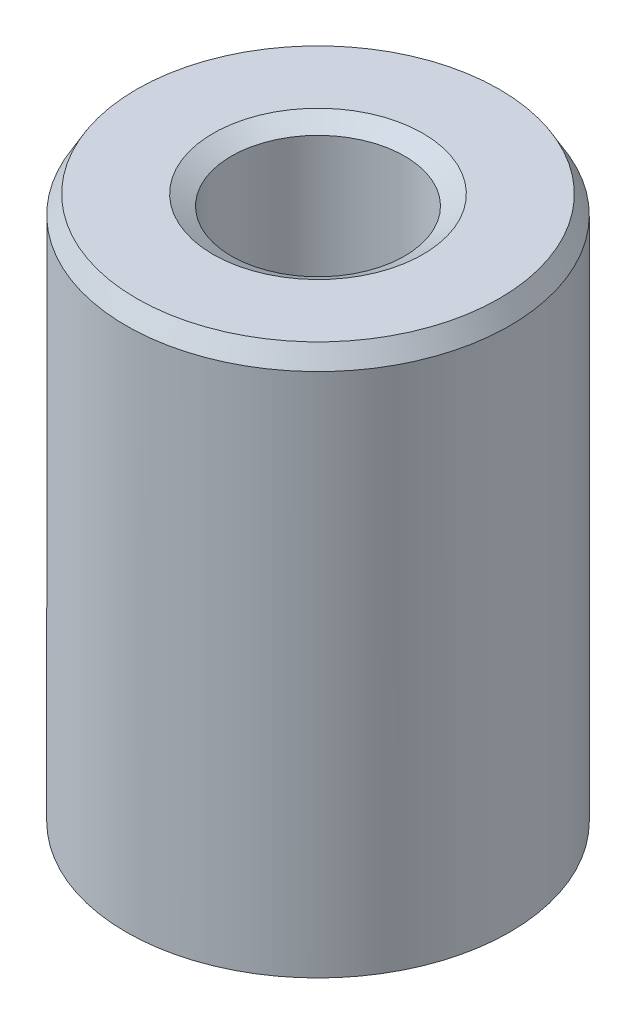
ISO-10303-21;
HEADER;
FILE_DESCRIPTION(('STEP AP214'),'2;1');
FILE_NAME('part.step','',(''),(''),'','','');
FILE_SCHEMA(('AUTOMOTIVE_DESIGN { 1 0 10303 214 1 1 1 1 }'));
ENDSEC;
DATA;
#1=APPLICATION_CONTEXT('core data for automotive mechanical design processes');
#2=APPLICATION_PROTOCOL_DEFINITION('international standard','automotive_design',2000,#1);
#3=PRODUCT_CONTEXT('',#1,'mechanical');
#4=PRODUCT('Part','Part','',(#3));
#5=PRODUCT_RELATED_PRODUCT_CATEGORY('part','',(#4));
#6=PRODUCT_DEFINITION_FORMATION('','',#4);
#7=PRODUCT_DEFINITION_CONTEXT('part definition',#1,'design');
#8=PRODUCT_DEFINITION('design','',#6,#7);
#9=PRODUCT_DEFINITION_SHAPE('','',#8);
#10=(LENGTH_UNIT() NAMED_UNIT(*) SI_UNIT(.MILLI.,.METRE.));
#11=(NAMED_UNIT(*) PLANE_ANGLE_UNIT() SI_UNIT($,.RADIAN.));
#12=(NAMED_UNIT(*) SI_UNIT($,.STERADIAN.) SOLID_ANGLE_UNIT());
#13=UNCERTAINTY_MEASURE_WITH_UNIT(LENGTH_MEASURE(1.E-05),#10,'distance_accuracy_value','');
#14=(GEOMETRIC_REPRESENTATION_CONTEXT(3) GLOBAL_UNCERTAINTY_ASSIGNED_CONTEXT((#13)) GLOBAL_UNIT_ASSIGNED_CONTEXT((#10,
#11,#12)) REPRESENTATION_CONTEXT('',''));
#15=CARTESIAN_POINT('',(0.,0.,0.));
#16=DIRECTION('',(0.,0.,1.));
#17=DIRECTION('',(1.,0.,0.));
#18=AXIS2_PLACEMENT_3D('',#15,#16,#17);
#19=CARTESIAN_POINT('',(0.,50.5357992017079,0.));
#20=DIRECTION('',(0.,-1.,0.));
#21=DIRECTION('',(0.,0.,-1.));
#22=AXIS2_PLACEMENT_3D('',#19,#20,#21);
#23=CYLINDRICAL_SURFACE('',#22,17.5);
#24=CARTESIAN_POINT('',(0.,0.962723807715823,0.));
#25=DIRECTION('',(0.,1.,0.));
#26=DIRECTION('',(0.,0.,1.));
#27=AXIS2_PLACEMENT_3D('',#24,#25,#26);
#28=CIRCLE('',#27,17.5);
#29=CARTESIAN_POINT('',(0.,0.962723807715823,-17.5));
#30=VERTEX_POINT('',#29);
#31=EDGE_CURVE('E10',#30,#30,#28,.T.);
#32=CARTESIAN_POINT('',(0.,48.8683126530879,0.));
#33=DIRECTION('',(0.,1.,0.));
#34=DIRECTION('',(0.,0.,1.));
#35=AXIS2_PLACEMENT_3D('',#32,#33,#34);
#36=CIRCLE('',#35,17.5);
#37=CARTESIAN_POINT('',(0.,48.8683126530879,-17.5));
#38=VERTEX_POINT('',#37);
#39=EDGE_CURVE('E50',#38,#38,#36,.F.);
#40=CARTESIAN_POINT('',(0.,0.962723807715823,-17.5));
#41=CARTESIAN_POINT('',(0.,1.46174035818845,-17.5));
#42=CARTESIAN_POINT('',(0.,1.96075690866108,-17.5));
#43=CARTESIAN_POINT('',(0.,2.95879000960633,-17.5));
#44=CARTESIAN_POINT('',(0.,3.45780656007895,-17.5));
#45=CARTESIAN_POINT('',(0.,4.45583966102421,-17.5));
#46=CARTESIAN_POINT('',(0.,4.95485621149683,-17.5));
#47=CARTESIAN_POINT('',(0.,5.95288931244208,-17.5));
#48=CARTESIAN_POINT('',(0.,6.45190586291471,-17.5));
#49=CARTESIAN_POINT('',(0.,7.44993896385996,-17.5));
#50=CARTESIAN_POINT('',(0.,7.94895551433259,-17.5));
#51=CARTESIAN_POINT('',(0.,8.94698861527784,-17.5));
#52=CARTESIAN_POINT('',(0.,9.44600516575047,-17.5));
#53=CARTESIAN_POINT('',(0.,10.4440382666957,-17.5));
#54=CARTESIAN_POINT('',(0.,10.9430548171683,-17.5));
#55=CARTESIAN_POINT('',(0.,11.9410879181136,-17.5));
#56=CARTESIAN_POINT('',(0.,12.4401044685862,-17.5));
#57=CARTESIAN_POINT('',(0.,13.4381375695315,-17.5));
#58=CARTESIAN_POINT('',(0.,13.9371541200041,-17.5));
#59=CARTESIAN_POINT('',(0.,14.9351872209494,-17.5));
#60=CARTESIAN_POINT('',(0.,15.434203771422,-17.5));
#61=CARTESIAN_POINT('',(0.,16.4322368723672,-17.5));
#62=CARTESIAN_POINT('',(0.,16.9312534228399,-17.5));
#63=CARTESIAN_POINT('',(0.,17.9292865237851,-17.5));
#64=CARTESIAN_POINT('',(0.,18.4283030742577,-17.5));
#65=CARTESIAN_POINT('',(0.,19.426336175203,-17.5));
#66=CARTESIAN_POINT('',(0.,19.9253527256756,-17.5));
#67=CARTESIAN_POINT('',(0.,20.9233858266209,-17.5));
#68=CARTESIAN_POINT('',(0.,21.4224023770935,-17.5));
#69=CARTESIAN_POINT('',(0.,22.4204354780387,-17.5));
#70=CARTESIAN_POINT('',(0.,22.9194520285114,-17.5));
#71=CARTESIAN_POINT('',(0.,23.9174851294566,-17.5));
#72=CARTESIAN_POINT('',(0.,24.4165016799292,-17.5));
#73=CARTESIAN_POINT('',(0.,25.4145347808745,-17.5));
#74=CARTESIAN_POINT('',(0.,25.9135513313471,-17.5));
#75=CARTESIAN_POINT('',(0.,26.9115844322924,-17.5));
#76=CARTESIAN_POINT('',(0.,27.410600982765,-17.5));
#77=CARTESIAN_POINT('',(0.,28.4086340837103,-17.5));
#78=CARTESIAN_POINT('',(0.,28.9076506341829,-17.5));
#79=CARTESIAN_POINT('',(0.,29.9056837351281,-17.5));
#80=CARTESIAN_POINT('',(0.,30.4047002856008,-17.5));
#81=CARTESIAN_POINT('',(0.,31.402733386546,-17.5));
#82=CARTESIAN_POINT('',(0.,31.9017499370186,-17.5));
#83=CARTESIAN_POINT('',(0.,32.8997830379639,-17.5));
#84=CARTESIAN_POINT('',(0.,33.3987995884365,-17.5));
#85=CARTESIAN_POINT('',(0.,34.3968326893818,-17.5));
#86=CARTESIAN_POINT('',(0.,34.8958492398544,-17.5));
#87=CARTESIAN_POINT('',(0.,35.8938823407996,-17.5));
#88=CARTESIAN_POINT('',(0.,36.3928988912723,-17.5));
#89=CARTESIAN_POINT('',(0.,37.3909319922175,-17.5));
#90=CARTESIAN_POINT('',(0.,37.8899485426902,-17.5));
#91=CARTESIAN_POINT('',(0.,38.8879816436354,-17.5));
#92=CARTESIAN_POINT('',(0.,39.386998194108,-17.5));
#93=CARTESIAN_POINT('',(0.,40.3850312950533,-17.5));
#94=CARTESIAN_POINT('',(0.,40.8840478455259,-17.5));
#95=CARTESIAN_POINT('',(0.,41.8820809464712,-17.5));
#96=CARTESIAN_POINT('',(0.,42.3810974969438,-17.5));
#97=CARTESIAN_POINT('',(0.,43.379130597889,-17.5));
#98=CARTESIAN_POINT('',(0.,43.8781471483617,-17.5));
#99=CARTESIAN_POINT('',(0.,44.8761802493069,-17.5));
#100=CARTESIAN_POINT('',(0.,45.3751967997795,-17.5));
#101=CARTESIAN_POINT('',(0.,46.3732299007248,-17.5));
#102=CARTESIAN_POINT('',(0.,46.8722464511974,-17.5));
#103=CARTESIAN_POINT('',(0.,47.8702795521427,-17.5));
#104=CARTESIAN_POINT('',(0.,48.3692961026153,-17.5));
#105=CARTESIAN_POINT('',(0.,48.8683126530879,-17.5));
#106=B_SPLINE_CURVE_WITH_KNOTS('',3,(#40,#41,#42,#43,#44,#45,#46,#47,#48,#49,#50,#51,#52,#53,
#54,#55,#56,#57,#58,#59,#60,#61,#62,#63,#64,#65,#66,#67,#68,#69,#70,#71,#72,#73,#74,#75,#76,#77,
#78,#79,#80,#81,#82,#83,#84,#85,#86,#87,#88,#89,#90,#91,#92,#93,#94,#95,#96,#97,#98,#99,#100,
#101,#102,#103,#104,#105),.UNSPECIFIED.,.F.,.F.,(4,2,2,2,2,2,2,2,2,2,2,2,2,2,2,2,2,2,2,2,2,2,2,
2,2,2,2,2,2,2,2,2,4),(0.,1.49704965141788,2.99409930283576,4.49114895425364,5.98819860567151,
7.48524825708939,8.98229790850727,10.4793475599251,11.976397211343,13.4734468627609,
14.9704965141788,16.4675461655967,17.9645958170145,19.4616454684324,20.9586951198503,
22.4557447712682,23.9527944226861,25.4498440741039,26.9468937255218,28.4439433769397,
29.9409930283576,31.4380426797754,32.9350923311933,34.4321419826112,35.9291916340291,
37.426241285447,38.9232909368648,40.4203405882827,41.9173902397006,43.4144398911185,
44.9114895425364,46.4085391939542,47.9055888453721),.UNSPECIFIED.);
#107=EDGE_CURVE('BSEAM39',#30,#38,#106,.T.);
#108=ORIENTED_EDGE('',*,*,#31,.T.);
#109=ORIENTED_EDGE('',*,*,#39,.T.);
#110=ORIENTED_EDGE('',*,*,#107,.T.);
#111=ORIENTED_EDGE('',*,*,#107,.F.);
#112=EDGE_LOOP('',(#108,#110,#109,#111));
#113=FACE_BOUND('',#112,.T.);
#114=ADVANCED_FACE('F39',(#113),#23,.T.);
#115=CARTESIAN_POINT('',(0.,50.5357992017079,0.));
#116=DIRECTION('',(0.,1.,0.));
#117=DIRECTION('',(0.,0.,1.));
#118=AXIS2_PLACEMENT_3D('',#115,#116,#117);
#119=PLANE('',#118);
#120=CARTESIAN_POINT('',(0.,50.5357992017079,0.));
#121=DIRECTION('',(0.,1.,0.));
#122=DIRECTION('',(0.,0.,1.));
#123=AXIS2_PLACEMENT_3D('',#120,#121,#122);
#124=CIRCLE('',#123,9.57150780662763);
#125=CARTESIAN_POINT('',(0.,50.5357992017079,9.57150780662763));
#126=VERTEX_POINT('',#125);
#127=EDGE_CURVE('E58',#126,#126,#124,.F.);
#128=ORIENTED_EDGE('',*,*,#127,.T.);
#129=EDGE_LOOP('',(#128));
#130=FACE_BOUND('',#129,.T.);
#131=CARTESIAN_POINT('',(0.,50.5357992017079,0.));
#132=DIRECTION('',(0.,1.,0.));
#133=DIRECTION('',(0.,0.,1.));
#134=AXIS2_PLACEMENT_3D('',#131,#132,#133);
#135=CIRCLE('',#134,16.5372761922842);
#136=CARTESIAN_POINT('',(0.,50.5357992017079,-16.5372761922842));
#137=VERTEX_POINT('',#136);
#138=EDGE_CURVE('E61',#137,#137,#135,.T.);
#139=ORIENTED_EDGE('',*,*,#138,.T.);
#140=EDGE_LOOP('',(#139));
#141=FACE_BOUND('',#140,.T.);
#142=ADVANCED_FACE('F88',(#130,#141),#119,.T.);
#143=CARTESIAN_POINT('',(0.,0.,0.));
#144=DIRECTION('',(0.,1.,0.));
#145=DIRECTION('',(0.,0.,1.));
#146=AXIS2_PLACEMENT_3D('',#143,#144,#145);
#147=PLANE('',#146);
#148=CARTESIAN_POINT('',(0.,0.,0.));
#149=DIRECTION('',(0.,1.,0.));
#150=DIRECTION('',(0.,0.,1.));
#151=AXIS2_PLACEMENT_3D('',#148,#149,#150);
#152=CIRCLE('',#151,8.86674506572347);
#153=CARTESIAN_POINT('',(0.,0.,8.86674506572347));
#154=VERTEX_POINT('',#153);
#155=EDGE_CURVE('E51',#154,#154,#152,.T.);
#156=ORIENTED_EDGE('',*,*,#155,.T.);
#157=EDGE_LOOP('',(#156));
#158=FACE_BOUND('',#157,.T.);
#159=CARTESIAN_POINT('',(0.,0.,0.));
#160=DIRECTION('',(0.,1.,0.));
#161=DIRECTION('',(0.,0.,1.));
#162=AXIS2_PLACEMENT_3D('',#159,#160,#161);
#163=CIRCLE('',#162,15.83251345138);
#164=CARTESIAN_POINT('',(0.,0.,15.83251345138));
#165=VERTEX_POINT('',#164);
#166=EDGE_CURVE('E54',#165,#165,#163,.F.);
#167=ORIENTED_EDGE('',*,*,#166,.T.);
#168=EDGE_LOOP('',(#167));
#169=FACE_BOUND('',#168,.T.);
#170=ADVANCED_FACE('F83',(#158,#169),#147,.F.);
#171=CARTESIAN_POINT('',(0.,50.5357992017079,0.));
#172=DIRECTION('',(0.,-1.,0.));
#173=DIRECTION('',(0.,0.,-1.));
#174=AXIS2_PLACEMENT_3D('',#171,#172,#173);
#175=CYLINDRICAL_SURFACE('',#174,7.90402125800765);
#176=CARTESIAN_POINT('',(0.,49.5730753939921,0.));
#177=DIRECTION('',(0.,1.,0.));
#178=DIRECTION('',(0.,0.,1.));
#179=AXIS2_PLACEMENT_3D('',#176,#177,#178);
#180=CIRCLE('',#179,7.90402125800765);
#181=CARTESIAN_POINT('',(0.,49.5730753939921,7.90402125800764));
#182=VERTEX_POINT('',#181);
#183=EDGE_CURVE('E67',#182,#182,#180,.T.);
#184=ORIENTED_EDGE('',*,*,#183,.T.);
#185=EDGE_LOOP('',(#184));
#186=FACE_BOUND('',#185,.T.);
#187=CARTESIAN_POINT('',(0.,1.66748654861999,0.));
#188=DIRECTION('',(0.,1.,0.));
#189=DIRECTION('',(0.,0.,1.));
#190=AXIS2_PLACEMENT_3D('',#187,#188,#189);
#191=CIRCLE('',#190,7.90402125800765);
#192=CARTESIAN_POINT('',(0.,1.66748654861999,7.90402125800765));
#193=VERTEX_POINT('',#192);
#194=EDGE_CURVE('E69',#193,#193,#191,.F.);
#195=ORIENTED_EDGE('',*,*,#194,.T.);
#196=EDGE_LOOP('',(#195));
#197=FACE_BOUND('',#196,.T.);
#198=ADVANCED_FACE('F71',(#186,#197),#175,.F.);
#199=CARTESIAN_POINT('',(0.,49.5730753939921,0.));
#200=DIRECTION('',(0.,1.,0.));
#201=DIRECTION('',(0.,0.,1.));
#202=AXIS2_PLACEMENT_3D('',#199,#200,#201);
#203=CONICAL_SURFACE('',#202,7.90402125800765,1.0471975511966);
#204=CARTESIAN_POINT('',(0.,50.5357992017079,9.57150780662763));
#205=CARTESIAN_POINT('',(0.,50.5257708287108,9.5541381550795));
#206=CARTESIAN_POINT('',(0.,50.5157424557138,9.53676850353138));
#207=CARTESIAN_POINT('',(0.,50.4956857097197,9.50202920043512));
#208=CARTESIAN_POINT('',(0.,50.4856573367227,9.484659548887));
#209=CARTESIAN_POINT('',(0.,50.4656005907286,9.44992024579075));
#210=CARTESIAN_POINT('',(0.,50.4555722177316,9.43255059424263));
#211=CARTESIAN_POINT('',(0.,50.4355154717375,9.39781129114638));
#212=CARTESIAN_POINT('',(0.,50.4254870987405,9.38044163959825));
#213=CARTESIAN_POINT('',(0.,50.4054303527464,9.345702336502));
#214=CARTESIAN_POINT('',(0.,50.3954019797493,9.32833268495388));
#215=CARTESIAN_POINT('',(0.,50.3753452337553,9.29359338185763));
#216=CARTESIAN_POINT('',(0.,50.3653168607582,9.27622373030951));
#217=CARTESIAN_POINT('',(0.,50.3452601147641,9.24148442721325));
#218=CARTESIAN_POINT('',(0.,50.3352317417671,9.22411477566513));
#219=CARTESIAN_POINT('',(0.,50.315174995773,9.18937547256888));
#220=CARTESIAN_POINT('',(0.,50.305146622776,9.17200582102075));
#221=CARTESIAN_POINT('',(0.,50.2850898767819,9.13726651792451));
#222=CARTESIAN_POINT('',(0.,50.2750615037848,9.11989686637638));
#223=CARTESIAN_POINT('',(0.,50.2550047577908,9.08515756328013));
#224=CARTESIAN_POINT('',(0.,50.2449763847937,9.067787911732));
#225=CARTESIAN_POINT('',(0.,50.2249196387997,9.03304860863575));
#226=CARTESIAN_POINT('',(0.,50.2148912658026,9.01567895708763));
#227=CARTESIAN_POINT('',(0.,50.1948345198085,8.98093965399138));
#228=CARTESIAN_POINT('',(0.,50.1848061468115,8.96357000244326));
#229=CARTESIAN_POINT('',(0.,50.1647494008174,8.92883069934701));
#230=CARTESIAN_POINT('',(0.,50.1547210278204,8.91146104779888));
#231=CARTESIAN_POINT('',(0.,50.1346642818263,8.87672174470263));
#232=CARTESIAN_POINT('',(0.,50.1246359088293,8.85935209315451));
#233=CARTESIAN_POINT('',(0.,50.1045791628352,8.82461279005826));
#234=CARTESIAN_POINT('',(0.,50.0945507898381,8.80724313851013));
#235=CARTESIAN_POINT('',(0.,50.0744940438441,8.77250383541388));
#236=CARTESIAN_POINT('',(0.,50.064465670847,8.75513418386576));
#237=CARTESIAN_POINT('',(0.,50.0444089248529,8.72039488076951));
#238=CARTESIAN_POINT('',(0.,50.0343805518559,8.70302522922138));
#239=CARTESIAN_POINT('',(0.,50.0143238058618,8.66828592612513));
#240=CARTESIAN_POINT('',(0.,50.0042954328648,8.65091627457701));
#241=CARTESIAN_POINT('',(0.,49.9842386868707,8.61617697148076));
#242=CARTESIAN_POINT('',(0.,49.9742103138737,8.59880731993264));
#243=CARTESIAN_POINT('',(0.,49.9541535678796,8.56406801683639));
#244=CARTESIAN_POINT('',(0.,49.9441251948825,8.54669836528826));
#245=CARTESIAN_POINT('',(0.,49.9240684488885,8.51195906219201));
#246=CARTESIAN_POINT('',(0.,49.9140400758914,8.49458941064388));
#247=CARTESIAN_POINT('',(0.,49.8939833298973,8.45985010754764));
#248=CARTESIAN_POINT('',(0.,49.8839549569003,8.44248045599951));
#249=CARTESIAN_POINT('',(0.,49.8638982109062,8.40774115290326));
#250=CARTESIAN_POINT('',(0.,49.8538698379092,8.39037150135514));
#251=CARTESIAN_POINT('',(0.,49.8338130919151,8.35563219825888));
#252=CARTESIAN_POINT('',(0.,49.8237847189181,8.33826254671076));
#253=CARTESIAN_POINT('',(0.,49.803727972924,8.30352324361451));
#254=CARTESIAN_POINT('',(0.,49.7936995999269,8.28615359206639));
#255=CARTESIAN_POINT('',(0.,49.7736428539329,8.25141428897014));
#256=CARTESIAN_POINT('',(0.,49.7636144809358,8.23404463742201));
#257=CARTESIAN_POINT('',(0.,49.7435577349417,8.19930533432576));
#258=CARTESIAN_POINT('',(0.,49.7335293619447,8.18193568277764));
#259=CARTESIAN_POINT('',(0.,49.7134726159506,8.14719637968139));
#260=CARTESIAN_POINT('',(0.,49.7034442429536,8.12982672813326));
#261=CARTESIAN_POINT('',(0.,49.6833874969595,8.09508742503701));
#262=CARTESIAN_POINT('',(0.,49.6733591239625,8.07771777348889));
#263=CARTESIAN_POINT('',(0.,49.6533023779684,8.04297847039264));
#264=CARTESIAN_POINT('',(0.,49.6432740049713,8.02560881884451));
#265=CARTESIAN_POINT('',(0.,49.6232172589773,7.99086951574826));
#266=CARTESIAN_POINT('',(0.,49.6131888859802,7.97349986420014));
#267=CARTESIAN_POINT('',(0.,49.5931321399861,7.93876056110389));
#268=CARTESIAN_POINT('',(0.,49.5831037669891,7.92139090955577));
#269=CARTESIAN_POINT('',(0.,49.5730753939921,7.90402125800764));
#270=B_SPLINE_CURVE_WITH_KNOTS('',3,(#204,#205,#206,#207,#208,#209,#210,#211,#212,#213,#214,
#215,#216,#217,#218,#219,#220,#221,#222,#223,#224,#225,#226,#227,#228,#229,#230,#231,#232,#233,
#234,#235,#236,#237,#238,#239,#240,#241,#242,#243,#244,#245,#246,#247,#248,#249,#250,#251,#252,
#253,#254,#255,#256,#257,#258,#259,#260,#261,#262,#263,#264,#265,#266,#267,#268,#269),
.UNSPECIFIED.,.F.,.F.,(4,2,2,2,2,2,2,2,2,2,2,2,2,2,2,2,2,2,2,2,2,2,2,2,2,2,2,2,2,2,2,2,4),(0.,
0.0601702379822381,0.120340475964478,0.180510713946718,0.240680951928955,0.300851189911195,
0.361021427893435,0.421191665875673,0.481361903857913,0.541532141840154,0.60170237982239,
0.66187261780463,0.72204285578687,0.782213093769107,0.842383331751348,0.902553569733588,
0.962723807715828,1.02289404569807,1.08306428368031,1.14323452166255,1.20340475964478,
1.26357499762702,1.32374523560926,1.3839154735915,1.44408571157374,1.50425594955598,
1.56442618753822,1.62459642552046,1.6847666635027,1.74493690148493,1.80510713946717,
1.86527737744941,1.92544761543165),.UNSPECIFIED.);
#271=EDGE_CURVE('BSEAM77',#126,#182,#270,.T.);
#272=ORIENTED_EDGE('',*,*,#127,.F.);
#273=ORIENTED_EDGE('',*,*,#183,.F.);
#274=ORIENTED_EDGE('',*,*,#271,.T.);
#275=ORIENTED_EDGE('',*,*,#271,.F.);
#276=EDGE_LOOP('',(#272,#274,#273,#275));
#277=FACE_BOUND('',#276,.T.);
#278=ADVANCED_FACE('F77',(#277),#203,.F.);
#279=CARTESIAN_POINT('',(0.,0.,0.));
#280=DIRECTION('',(0.,-1.,0.));
#281=DIRECTION('',(0.,0.,-1.));
#282=AXIS2_PLACEMENT_3D('',#279,#280,#281);
#283=CONICAL_SURFACE('',#282,8.86674506572347,0.523598775598296);
#284=ORIENTED_EDGE('',*,*,#194,.F.);
#285=EDGE_LOOP('',(#284));
#286=FACE_BOUND('',#285,.T.);
#287=ORIENTED_EDGE('',*,*,#155,.F.);
#288=EDGE_LOOP('',(#287));
#289=FACE_BOUND('',#288,.T.);
#290=ADVANCED_FACE('F73',(#286,#289),#283,.F.);
#291=CARTESIAN_POINT('',(0.,0.962723807715823,0.));
#292=DIRECTION('',(0.,1.,0.));
#293=DIRECTION('',(0.,0.,1.));
#294=AXIS2_PLACEMENT_3D('',#291,#292,#293);
#295=CONICAL_SURFACE('',#294,17.5,1.0471975511966);
#296=ORIENTED_EDGE('',*,*,#166,.F.);
#297=EDGE_LOOP('',(#296));
#298=FACE_BOUND('',#297,.T.);
#299=ORIENTED_EDGE('',*,*,#31,.F.);
#300=EDGE_LOOP('',(#299));
#301=FACE_BOUND('',#300,.T.);
#302=ADVANCED_FACE('F76',(#298,#301),#295,.T.);
#303=CARTESIAN_POINT('',(0.,50.5357992017079,0.));
#304=DIRECTION('',(0.,-1.,0.));
#305=DIRECTION('',(0.,0.,-1.));
#306=AXIS2_PLACEMENT_3D('',#303,#304,#305);
#307=CONICAL_SURFACE('',#306,16.5372761922842,0.523598775598296);
#308=CARTESIAN_POINT('',(0.,48.8683126530879,-17.5));
#309=CARTESIAN_POINT('',(0.,48.8856823046361,-17.489971627003));
#310=CARTESIAN_POINT('',(0.,48.9030519561842,-17.4799432540059));
#311=CARTESIAN_POINT('',(0.,48.9377912592804,-17.4598865080118));
#312=CARTESIAN_POINT('',(0.,48.9551609108286,-17.4498581350148));
#313=CARTESIAN_POINT('',(0.,48.9899002139248,-17.4298013890207));
#314=CARTESIAN_POINT('',(0.,49.0072698654729,-17.4197730160237));
#315=CARTESIAN_POINT('',(0.,49.0420091685692,-17.3997162700296));
#316=CARTESIAN_POINT('',(0.,49.0593788201173,-17.3896878970326));
#317=CARTESIAN_POINT('',(0.,49.0941181232135,-17.3696311510385));
#318=CARTESIAN_POINT('',(0.,49.1114877747617,-17.3596027780415));
#319=CARTESIAN_POINT('',(0.,49.1462270778579,-17.3395460320474));
#320=CARTESIAN_POINT('',(0.,49.163596729406,-17.3295176590503));
#321=CARTESIAN_POINT('',(0.,49.1983360325023,-17.3094609130563));
#322=CARTESIAN_POINT('',(0.,49.2157056840504,-17.2994325400592));
#323=CARTESIAN_POINT('',(0.,49.2504449871467,-17.2793757940651));
#324=CARTESIAN_POINT('',(0.,49.2678146386948,-17.2693474210681));
#325=CARTESIAN_POINT('',(0.,49.302553941791,-17.249290675074));
#326=CARTESIAN_POINT('',(0.,49.3199235933392,-17.239262302077));
#327=CARTESIAN_POINT('',(0.,49.3546628964354,-17.2192055560829));
#328=CARTESIAN_POINT('',(0.,49.3720325479835,-17.2091771830859));
#329=CARTESIAN_POINT('',(0.,49.4067718510798,-17.1891204370918));
#330=CARTESIAN_POINT('',(0.,49.4241415026279,-17.1790920640947));
#331=CARTESIAN_POINT('',(0.,49.4588808057242,-17.1590353181007));
#332=CARTESIAN_POINT('',(0.,49.4762504572723,-17.1490069451036));
#333=CARTESIAN_POINT('',(0.,49.5109897603685,-17.1289501991095));
#334=CARTESIAN_POINT('',(0.,49.5283594119167,-17.1189218261125));
#335=CARTESIAN_POINT('',(0.,49.5630987150129,-17.0988650801184));
#336=CARTESIAN_POINT('',(0.,49.580468366561,-17.0888367071214));
#337=CARTESIAN_POINT('',(0.,49.6152076696573,-17.0687799611273));
#338=CARTESIAN_POINT('',(0.,49.6325773212054,-17.0587515881303));
#339=CARTESIAN_POINT('',(0.,49.6673166243017,-17.0386948421362));
#340=CARTESIAN_POINT('',(0.,49.6846862758498,-17.0286664691391));
#341=CARTESIAN_POINT('',(0.,49.719425578946,-17.0086097231451));
#342=CARTESIAN_POINT('',(0.,49.7367952304942,-16.998581350148));
#343=CARTESIAN_POINT('',(0.,49.7715345335904,-16.9785246041539));
#344=CARTESIAN_POINT('',(0.,49.7889041851385,-16.9684962311569));
#345=CARTESIAN_POINT('',(0.,49.8236434882348,-16.9484394851628));
#346=CARTESIAN_POINT('',(0.,49.8410131397829,-16.9384111121658));
#347=CARTESIAN_POINT('',(0.,49.8757524428792,-16.9183543661717));
#348=CARTESIAN_POINT('',(0.,49.8931220944273,-16.9083259931747));
#349=CARTESIAN_POINT('',(0.,49.9278613975235,-16.8882692471806));
#350=CARTESIAN_POINT('',(0.,49.9452310490717,-16.8782408741835));
#351=CARTESIAN_POINT('',(0.,49.9799703521679,-16.8581841281895));
#352=CARTESIAN_POINT('',(0.,49.997340003716,-16.8481557551924));
#353=CARTESIAN_POINT('',(0.,50.0320793068123,-16.8280990091984));
#354=CARTESIAN_POINT('',(0.,50.0494489583604,-16.8180706362013));
#355=CARTESIAN_POINT('',(0.,50.0841882614567,-16.7980138902072));
#356=CARTESIAN_POINT('',(0.,50.1015579130048,-16.7879855172102));
#357=CARTESIAN_POINT('',(0.,50.136297216101,-16.7679287712161));
#358=CARTESIAN_POINT('',(0.,50.1536668676491,-16.7579003982191));
#359=CARTESIAN_POINT('',(0.,50.1884061707454,-16.737843652225));
#360=CARTESIAN_POINT('',(0.,50.2057758222935,-16.727815279228));
#361=CARTESIAN_POINT('',(0.,50.2405151253898,-16.7077585332339));
#362=CARTESIAN_POINT('',(0.,50.2578847769379,-16.6977301602368));
#363=CARTESIAN_POINT('',(0.,50.2926240800341,-16.6776734142428));
#364=CARTESIAN_POINT('',(0.,50.3099937315823,-16.6676450412457));
#365=CARTESIAN_POINT('',(0.,50.3447330346785,-16.6475882952516));
#366=CARTESIAN_POINT('',(0.,50.3621026862266,-16.6375599222546));
#367=CARTESIAN_POINT('',(0.,50.3968419893229,-16.6175031762605));
#368=CARTESIAN_POINT('',(0.,50.414211640871,-16.6074748032635));
#369=CARTESIAN_POINT('',(0.,50.4489509439673,-16.5874180572694));
#370=CARTESIAN_POINT('',(0.,50.4663205955154,-16.5773896842724));
#371=CARTESIAN_POINT('',(0.,50.5010598986116,-16.5573329382783));
#372=CARTESIAN_POINT('',(0.,50.5184295501598,-16.5473045652812));
#373=CARTESIAN_POINT('',(0.,50.5357992017079,-16.5372761922842));
#374=B_SPLINE_CURVE_WITH_KNOTS('',3,(#308,#309,#310,#311,#312,#313,#314,#315,#316,#317,#318,
#319,#320,#321,#322,#323,#324,#325,#326,#327,#328,#329,#330,#331,#332,#333,#334,#335,#336,#337,
#338,#339,#340,#341,#342,#343,#344,#345,#346,#347,#348,#349,#350,#351,#352,#353,#354,#355,#356,
#357,#358,#359,#360,#361,#362,#363,#364,#365,#366,#367,#368,#369,#370,#371,#372,#373),
.UNSPECIFIED.,.F.,.F.,(4,2,2,2,2,2,2,2,2,2,2,2,2,2,2,2,2,2,2,2,2,2,2,2,2,2,2,2,2,2,2,2,4),(0.,
0.0601702379822386,0.120340475964475,0.180510713946712,0.240680951928949,0.300851189911188,
0.361021427893425,0.421191665875667,0.481361903857904,0.541532141840141,0.60170237982238,
0.661872617804617,0.722042855786854,0.782213093769097,0.842383331751335,0.902553569733572,
0.962723807715809,1.02289404569805,1.08306428368028,1.14323452166252,1.20340475964476,
1.263574997627,1.32374523560924,1.38391547359147,1.44408571157371,1.50425594955595,
1.56442618753819,1.62459642552043,1.68476666350267,1.7449369014849,1.80510713946714,
1.86527737744938,1.92544761543162),.UNSPECIFIED.);
#375=EDGE_CURVE('BSEAM45',#38,#137,#374,.T.);
#376=ORIENTED_EDGE('',*,*,#39,.F.);
#377=ORIENTED_EDGE('',*,*,#138,.F.);
#378=ORIENTED_EDGE('',*,*,#375,.T.);
#379=ORIENTED_EDGE('',*,*,#375,.F.);
#380=EDGE_LOOP('',(#376,#378,#377,#379));
#381=FACE_BOUND('',#380,.T.);
#382=ADVANCED_FACE('F45',(#381),#307,.T.);
#383=CLOSED_SHELL('',(#114,#142,#170,#198,#278,#290,#302,#382));
#384=MANIFOLD_SOLID_BREP('B2',#383);
#385=ADVANCED_BREP_SHAPE_REPRESENTATION('',(#18,#384),#14);
#386=SHAPE_DEFINITION_REPRESENTATION(#9,#385);
ENDSEC;
END-ISO-10303-21;
